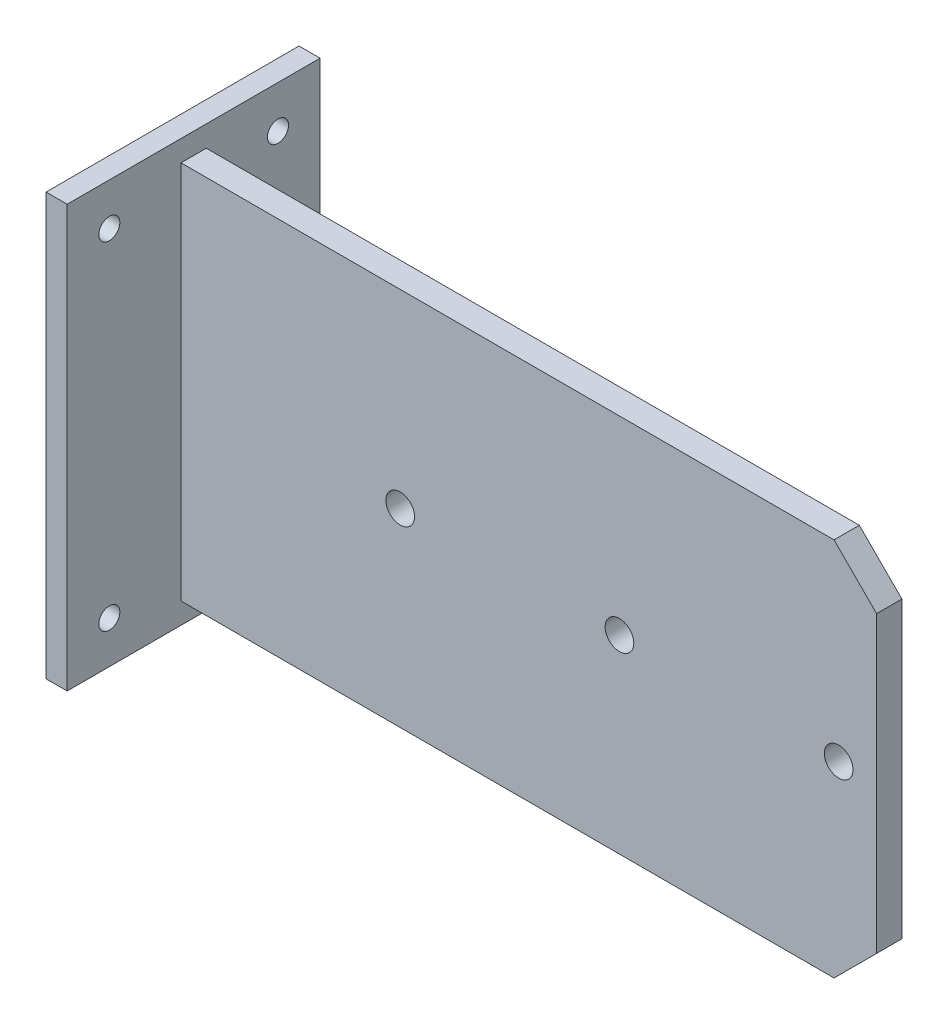
ISO-10303-21;
HEADER;
FILE_DESCRIPTION(('STEP AP214'),'2;1');
FILE_NAME('part.step','',(''),(''),'','','');
FILE_SCHEMA(('AUTOMOTIVE_DESIGN { 1 0 10303 214 1 1 1 1 }'));
ENDSEC;
DATA;
#1=APPLICATION_CONTEXT('core data for automotive mechanical design processes');
#2=APPLICATION_PROTOCOL_DEFINITION('international standard','automotive_design',2000,#1);
#3=PRODUCT_CONTEXT('',#1,'mechanical');
#4=PRODUCT('Part','Part','',(#3));
#5=PRODUCT_RELATED_PRODUCT_CATEGORY('part','',(#4));
#6=PRODUCT_DEFINITION_FORMATION('','',#4);
#7=PRODUCT_DEFINITION_CONTEXT('part definition',#1,'design');
#8=PRODUCT_DEFINITION('design','',#6,#7);
#9=PRODUCT_DEFINITION_SHAPE('','',#8);
#10=(LENGTH_UNIT() NAMED_UNIT(*) SI_UNIT(.MILLI.,.METRE.));
#11=(NAMED_UNIT(*) PLANE_ANGLE_UNIT() SI_UNIT($,.RADIAN.));
#12=(NAMED_UNIT(*) SI_UNIT($,.STERADIAN.) SOLID_ANGLE_UNIT());
#13=UNCERTAINTY_MEASURE_WITH_UNIT(LENGTH_MEASURE(1.E-05),#10,'distance_accuracy_value','');
#14=(GEOMETRIC_REPRESENTATION_CONTEXT(3) GLOBAL_UNCERTAINTY_ASSIGNED_CONTEXT((#13)) GLOBAL_UNIT_ASSIGNED_CONTEXT((#10,
#11,#12)) REPRESENTATION_CONTEXT('',''));
#15=CARTESIAN_POINT('',(0.,0.,0.));
#16=DIRECTION('',(0.,0.,1.));
#17=DIRECTION('',(1.,0.,0.));
#18=AXIS2_PLACEMENT_3D('',#15,#16,#17);
#19=CARTESIAN_POINT('',(63.4999999999999,-1270.,762.));
#20=DIRECTION('',(-1.,0.,0.));
#21=DIRECTION('',(0.,0.,1.));
#22=AXIS2_PLACEMENT_3D('',#19,#20,#21);
#23=PLANE('',#22);
#24=CARTESIAN_POINT('',(63.4999999999999,1016.,508.));
#25=DIRECTION('',(-1.,0.,0.));
#26=DIRECTION('',(0.,0.,1.));
#27=AXIS2_PLACEMENT_3D('',#24,#25,#26);
#28=CIRCLE('',#27,63.4999999999999);
#29=CARTESIAN_POINT('',(63.4999999999999,1016.,571.5));
#30=VERTEX_POINT('',#29);
#31=EDGE_CURVE('E158',#30,#30,#28,.T.);
#32=ORIENTED_EDGE('',*,*,#31,.T.);
#33=EDGE_LOOP('',(#32));
#34=FACE_BOUND('',#33,.T.);
#35=CARTESIAN_POINT('',(63.4999999999999,-1016.,508.));
#36=DIRECTION('',(-1.,0.,0.));
#37=DIRECTION('',(0.,0.,1.));
#38=AXIS2_PLACEMENT_3D('',#35,#36,#37);
#39=CIRCLE('',#38,63.5);
#40=CARTESIAN_POINT('',(63.4999999999999,-1016.,571.5));
#41=VERTEX_POINT('',#40);
#42=EDGE_CURVE('E391',#41,#41,#39,.T.);
#43=ORIENTED_EDGE('',*,*,#42,.T.);
#44=EDGE_LOOP('',(#43));
#45=FACE_BOUND('',#44,.T.);
#46=CARTESIAN_POINT('',(63.4999999999999,-1016.,-508.));
#47=DIRECTION('',(-1.,0.,0.));
#48=DIRECTION('',(0.,0.,1.));
#49=AXIS2_PLACEMENT_3D('',#46,#47,#48);
#50=CIRCLE('',#49,63.5);
#51=CARTESIAN_POINT('',(63.4999999999999,-1016.,-444.5));
#52=VERTEX_POINT('',#51);
#53=EDGE_CURVE('E388',#52,#52,#50,.T.);
#54=ORIENTED_EDGE('',*,*,#53,.T.);
#55=EDGE_LOOP('',(#54));
#56=FACE_BOUND('',#55,.T.);
#57=CARTESIAN_POINT('',(63.4999999999999,1016.,-508.));
#58=DIRECTION('',(-1.,0.,0.));
#59=DIRECTION('',(0.,0.,1.));
#60=AXIS2_PLACEMENT_3D('',#57,#58,#59);
#61=CIRCLE('',#60,63.5);
#62=CARTESIAN_POINT('',(63.4999999999999,1016.,-444.5));
#63=VERTEX_POINT('',#62);
#64=EDGE_CURVE('E384',#63,#63,#61,.T.);
#65=ORIENTED_EDGE('',*,*,#64,.T.);
#66=EDGE_LOOP('',(#65));
#67=FACE_BOUND('',#66,.T.);
#68=DIRECTION('',(0.,1.,0.));
#69=VECTOR('',#68,1.);
#70=CARTESIAN_POINT('',(63.4999999999999,-1270.,-762.));
#71=LINE('',#70,#69);
#72=CARTESIAN_POINT('',(63.4999999999999,-1270.,-762.));
#73=VERTEX_POINT('',#72);
#74=CARTESIAN_POINT('',(63.4999999999999,1270.,-762.));
#75=VERTEX_POINT('',#74);
#76=EDGE_CURVE('E197',#73,#75,#71,.T.);
#77=ORIENTED_EDGE('',*,*,#76,.T.);
#78=DIRECTION('',(0.,0.,-1.));
#79=VECTOR('',#78,1.);
#80=CARTESIAN_POINT('',(63.4999999999999,1270.,762.));
#81=LINE('',#80,#79);
#82=CARTESIAN_POINT('',(63.4999999999999,1270.,762.));
#83=VERTEX_POINT('',#82);
#84=EDGE_CURVE('E205',#83,#75,#81,.T.);
#85=ORIENTED_EDGE('',*,*,#84,.F.);
#86=DIRECTION('',(0.,1.,0.));
#87=VECTOR('',#86,1.);
#88=CARTESIAN_POINT('',(63.4999999999999,-1270.,762.));
#89=LINE('',#88,#87);
#90=CARTESIAN_POINT('',(63.4999999999999,-1270.,762.));
#91=VERTEX_POINT('',#90);
#92=EDGE_CURVE('E184',#91,#83,#89,.T.);
#93=ORIENTED_EDGE('',*,*,#92,.F.);
#94=DIRECTION('',(0.,0.,-1.));
#95=VECTOR('',#94,1.);
#96=CARTESIAN_POINT('',(63.4999999999999,-1270.,762.));
#97=LINE('',#96,#95);
#98=EDGE_CURVE('E209',#91,#73,#97,.T.);
#99=ORIENTED_EDGE('',*,*,#98,.T.);
#100=EDGE_LOOP('',(#77,#85,#93,#99));
#101=FACE_BOUND('',#100,.T.);
#102=DIRECTION('',(0.,1.,0.));
#103=VECTOR('',#102,1.);
#104=CARTESIAN_POINT('',(63.5000000000002,-1143.,76.2));
#105=LINE('',#104,#103);
#106=CARTESIAN_POINT('',(63.5000000000002,-1143.,76.2));
#107=VERTEX_POINT('',#106);
#108=CARTESIAN_POINT('',(63.4999999999999,1143.,76.2));
#109=VERTEX_POINT('',#108);
#110=EDGE_CURVE('E144',#107,#109,#105,.T.);
#111=ORIENTED_EDGE('',*,*,#110,.T.);
#112=DIRECTION('',(0.,0.,-1.));
#113=VECTOR('',#112,1.);
#114=CARTESIAN_POINT('',(63.4999999999999,1143.,76.2));
#115=LINE('',#114,#113);
#116=CARTESIAN_POINT('',(63.4999999999999,1143.,-76.2));
#117=VERTEX_POINT('',#116);
#118=EDGE_CURVE('E126',#109,#117,#115,.T.);
#119=ORIENTED_EDGE('',*,*,#118,.T.);
#120=DIRECTION('',(0.,1.,0.));
#121=VECTOR('',#120,1.);
#122=CARTESIAN_POINT('',(63.5000000000002,-1143.,-76.2));
#123=LINE('',#122,#121);
#124=CARTESIAN_POINT('',(63.4999999999999,-1143.,-76.2));
#125=VERTEX_POINT('',#124);
#126=EDGE_CURVE('E165',#125,#117,#123,.T.);
#127=ORIENTED_EDGE('',*,*,#126,.F.);
#128=DIRECTION('',(0.,0.,-1.));
#129=VECTOR('',#128,1.);
#130=CARTESIAN_POINT('',(63.5000000000002,-1143.,76.2));
#131=LINE('',#130,#129);
#132=EDGE_CURVE('E139',#107,#125,#131,.T.);
#133=ORIENTED_EDGE('',*,*,#132,.F.);
#134=EDGE_LOOP('',(#111,#119,#127,#133));
#135=FACE_BOUND('',#134,.T.);
#136=ADVANCED_FACE('F47',(#34,#45,#56,#67,#101,#135),#23,.F.);
#137=CARTESIAN_POINT('',(-63.5000000000001,-1270.,762.));
#138=DIRECTION('',(1.,0.,0.));
#139=DIRECTION('',(0.,0.,-1.));
#140=AXIS2_PLACEMENT_3D('',#137,#138,#139);
#141=PLANE('',#140);
#142=CARTESIAN_POINT('',(-63.5000000000001,1016.,508.));
#143=DIRECTION('',(-1.,0.,0.));
#144=DIRECTION('',(0.,0.,-1.));
#145=AXIS2_PLACEMENT_3D('',#142,#143,#144);
#146=CIRCLE('',#145,63.4999999999999);
#147=CARTESIAN_POINT('',(-63.5000000000001,1016.,444.5));
#148=VERTEX_POINT('',#147);
#149=EDGE_CURVE('E231',#148,#148,#146,.T.);
#150=ORIENTED_EDGE('',*,*,#149,.F.);
#151=EDGE_LOOP('',(#150));
#152=FACE_BOUND('',#151,.T.);
#153=CARTESIAN_POINT('',(-63.5000000000001,-1016.,508.));
#154=DIRECTION('',(-1.,0.,0.));
#155=DIRECTION('',(0.,0.,-1.));
#156=AXIS2_PLACEMENT_3D('',#153,#154,#155);
#157=CIRCLE('',#156,63.5);
#158=CARTESIAN_POINT('',(-63.5000000000001,-1016.,444.5));
#159=VERTEX_POINT('',#158);
#160=EDGE_CURVE('E374',#159,#159,#157,.T.);
#161=ORIENTED_EDGE('',*,*,#160,.F.);
#162=EDGE_LOOP('',(#161));
#163=FACE_BOUND('',#162,.T.);
#164=CARTESIAN_POINT('',(-63.5000000000001,-1016.,-508.));
#165=DIRECTION('',(-1.,0.,0.));
#166=DIRECTION('',(0.,0.,1.));
#167=AXIS2_PLACEMENT_3D('',#164,#165,#166);
#168=CIRCLE('',#167,63.5);
#169=CARTESIAN_POINT('',(-63.5000000000001,-1016.,-444.5));
#170=VERTEX_POINT('',#169);
#171=EDGE_CURVE('E369',#170,#170,#168,.T.);
#172=ORIENTED_EDGE('',*,*,#171,.F.);
#173=EDGE_LOOP('',(#172));
#174=FACE_BOUND('',#173,.T.);
#175=CARTESIAN_POINT('',(-63.5000000000001,1016.,-508.));
#176=DIRECTION('',(-1.,0.,0.));
#177=DIRECTION('',(0.,0.,1.));
#178=AXIS2_PLACEMENT_3D('',#175,#176,#177);
#179=CIRCLE('',#178,63.5);
#180=CARTESIAN_POINT('',(-63.5000000000001,1016.,-444.5));
#181=VERTEX_POINT('',#180);
#182=EDGE_CURVE('E373',#181,#181,#179,.T.);
#183=ORIENTED_EDGE('',*,*,#182,.F.);
#184=EDGE_LOOP('',(#183));
#185=FACE_BOUND('',#184,.T.);
#186=DIRECTION('',(0.,-1.,0.));
#187=VECTOR('',#186,1.);
#188=CARTESIAN_POINT('',(-63.5000000000001,-1270.,-762.));
#189=LINE('',#188,#187);
#190=CARTESIAN_POINT('',(-63.5000000000001,1270.,-762.));
#191=VERTEX_POINT('',#190);
#192=CARTESIAN_POINT('',(-63.5000000000001,-1270.,-762.));
#193=VERTEX_POINT('',#192);
#194=EDGE_CURVE('E174',#191,#193,#189,.T.);
#195=ORIENTED_EDGE('',*,*,#194,.T.);
#196=DIRECTION('',(0.,0.,-1.));
#197=VECTOR('',#196,1.);
#198=CARTESIAN_POINT('',(-63.5000000000001,-1270.,762.));
#199=LINE('',#198,#197);
#200=CARTESIAN_POINT('',(-63.5000000000001,-1270.,762.));
#201=VERTEX_POINT('',#200);
#202=EDGE_CURVE('E213',#201,#193,#199,.T.);
#203=ORIENTED_EDGE('',*,*,#202,.F.);
#204=DIRECTION('',(0.,-1.,0.));
#205=VECTOR('',#204,1.);
#206=CARTESIAN_POINT('',(-63.5000000000001,-1270.,762.));
#207=LINE('',#206,#205);
#208=CARTESIAN_POINT('',(-63.5000000000001,1270.,762.));
#209=VERTEX_POINT('',#208);
#210=EDGE_CURVE('E176',#209,#201,#207,.T.);
#211=ORIENTED_EDGE('',*,*,#210,.F.);
#212=DIRECTION('',(0.,0.,-1.));
#213=VECTOR('',#212,1.);
#214=CARTESIAN_POINT('',(-63.5000000000001,1270.,762.));
#215=LINE('',#214,#213);
#216=EDGE_CURVE('E190',#209,#191,#215,.T.);
#217=ORIENTED_EDGE('',*,*,#216,.T.);
#218=EDGE_LOOP('',(#195,#203,#211,#217));
#219=FACE_BOUND('',#218,.T.);
#220=ADVANCED_FACE('F266',(#152,#163,#174,#185,#219),#141,.F.);
#221=CARTESIAN_POINT('',(63.4999999999999,-1270.,762.));
#222=DIRECTION('',(0.,1.,0.));
#223=DIRECTION('',(0.,0.,1.));
#224=AXIS2_PLACEMENT_3D('',#221,#222,#223);
#225=PLANE('',#224);
#226=DIRECTION('',(1.,0.,0.));
#227=VECTOR('',#226,1.);
#228=CARTESIAN_POINT('',(63.4999999999999,-1270.,-762.));
#229=LINE('',#228,#227);
#230=EDGE_CURVE('E194',#193,#73,#229,.T.);
#231=ORIENTED_EDGE('',*,*,#230,.T.);
#232=ORIENTED_EDGE('',*,*,#98,.F.);
#233=DIRECTION('',(1.,0.,0.));
#234=VECTOR('',#233,1.);
#235=CARTESIAN_POINT('',(63.4999999999999,-1270.,762.));
#236=LINE('',#235,#234);
#237=EDGE_CURVE('E180',#201,#91,#236,.T.);
#238=ORIENTED_EDGE('',*,*,#237,.F.);
#239=ORIENTED_EDGE('',*,*,#202,.T.);
#240=EDGE_LOOP('',(#231,#232,#238,#239));
#241=FACE_BOUND('',#240,.T.);
#242=ADVANCED_FACE('F272',(#241),#225,.F.);
#243=CARTESIAN_POINT('',(63.4999999999999,1270.,762.));
#244=DIRECTION('',(0.,-1.,0.));
#245=DIRECTION('',(0.,0.,-1.));
#246=AXIS2_PLACEMENT_3D('',#243,#244,#245);
#247=PLANE('',#246);
#248=DIRECTION('',(-1.,0.,0.));
#249=VECTOR('',#248,1.);
#250=CARTESIAN_POINT('',(63.4999999999999,1270.,-762.));
#251=LINE('',#250,#249);
#252=EDGE_CURVE('E181',#75,#191,#251,.T.);
#253=ORIENTED_EDGE('',*,*,#252,.T.);
#254=ORIENTED_EDGE('',*,*,#216,.F.);
#255=DIRECTION('',(-1.,0.,0.));
#256=VECTOR('',#255,1.);
#257=CARTESIAN_POINT('',(63.4999999999999,1270.,762.));
#258=LINE('',#257,#256);
#259=EDGE_CURVE('E187',#83,#209,#258,.T.);
#260=ORIENTED_EDGE('',*,*,#259,.F.);
#261=ORIENTED_EDGE('',*,*,#84,.T.);
#262=EDGE_LOOP('',(#253,#254,#260,#261));
#263=FACE_BOUND('',#262,.T.);
#264=ADVANCED_FACE('F279',(#263),#247,.F.);
#265=CARTESIAN_POINT('',(0.,0.,762.));
#266=DIRECTION('',(0.,0.,1.));
#267=DIRECTION('',(1.,0.,0.));
#268=AXIS2_PLACEMENT_3D('',#265,#266,#267);
#269=PLANE('',#268);
#270=ORIENTED_EDGE('',*,*,#210,.T.);
#271=ORIENTED_EDGE('',*,*,#237,.T.);
#272=ORIENTED_EDGE('',*,*,#92,.T.);
#273=ORIENTED_EDGE('',*,*,#259,.T.);
#274=EDGE_LOOP('',(#270,#271,#272,#273));
#275=FACE_BOUND('',#274,.T.);
#276=ADVANCED_FACE('F291',(#275),#269,.T.);
#277=CARTESIAN_POINT('',(0.,0.,-762.));
#278=DIRECTION('',(0.,0.,1.));
#279=DIRECTION('',(1.,0.,0.));
#280=AXIS2_PLACEMENT_3D('',#277,#278,#279);
#281=PLANE('',#280);
#282=ORIENTED_EDGE('',*,*,#194,.F.);
#283=ORIENTED_EDGE('',*,*,#252,.F.);
#284=ORIENTED_EDGE('',*,*,#76,.F.);
#285=ORIENTED_EDGE('',*,*,#230,.F.);
#286=EDGE_LOOP('',(#282,#283,#284,#285));
#287=FACE_BOUND('',#286,.T.);
#288=ADVANCED_FACE('F302',(#287),#281,.F.);
#289=CARTESIAN_POINT('',(63.5000000000002,-1143.,76.2));
#290=DIRECTION('',(0.,1.,0.));
#291=DIRECTION('',(-1.,0.,0.));
#292=AXIS2_PLACEMENT_3D('',#289,#290,#291);
#293=PLANE('',#292);
#294=DIRECTION('',(1.,0.,0.));
#295=VECTOR('',#294,1.);
#296=CARTESIAN_POINT('',(63.5000000000002,-1143.,-76.2));
#297=LINE('',#296,#295);
#298=CARTESIAN_POINT('',(3997.96,-1143.,-76.2));
#299=VERTEX_POINT('',#298);
#300=EDGE_CURVE('E152',#125,#299,#297,.T.);
#301=ORIENTED_EDGE('',*,*,#300,.T.);
#302=DIRECTION('',(0.,0.,1.));
#303=VECTOR('',#302,1.);
#304=CARTESIAN_POINT('',(3997.96,-1143.,76.2));
#305=LINE('',#304,#303);
#306=CARTESIAN_POINT('',(3997.96,-1143.,76.2));
#307=VERTEX_POINT('',#306);
#308=EDGE_CURVE('E11',#299,#307,#305,.T.);
#309=ORIENTED_EDGE('',*,*,#308,.T.);
#310=DIRECTION('',(1.,0.,0.));
#311=VECTOR('',#310,1.);
#312=CARTESIAN_POINT('',(63.5000000000002,-1143.,76.2));
#313=LINE('',#312,#311);
#314=EDGE_CURVE('E140',#107,#307,#313,.T.);
#315=ORIENTED_EDGE('',*,*,#314,.F.);
#316=ORIENTED_EDGE('',*,*,#132,.T.);
#317=EDGE_LOOP('',(#301,#309,#315,#316));
#318=FACE_BOUND('',#317,.T.);
#319=ADVANCED_FACE('F258',(#318),#293,.F.);
#320=CARTESIAN_POINT('',(4254.5,1143.,76.2));
#321=DIRECTION('',(1.,0.,0.));
#322=DIRECTION('',(0.,0.,-1.));
#323=AXIS2_PLACEMENT_3D('',#320,#321,#322);
#324=PLANE('',#323);
#325=DIRECTION('',(0.,-1.,0.));
#326=VECTOR('',#325,1.);
#327=CARTESIAN_POINT('',(4254.5,1143.,-76.2));
#328=LINE('',#327,#326);
#329=CARTESIAN_POINT('',(4254.5,886.459999999999,-76.2));
#330=VERTEX_POINT('',#329);
#331=CARTESIAN_POINT('',(4254.5,-886.459999999998,-76.2));
#332=VERTEX_POINT('',#331);
#333=EDGE_CURVE('E155',#330,#332,#328,.T.);
#334=ORIENTED_EDGE('',*,*,#333,.F.);
#335=DIRECTION('',(0.,0.,1.));
#336=VECTOR('',#335,1.);
#337=CARTESIAN_POINT('',(4254.5,886.459999999999,76.2));
#338=LINE('',#337,#336);
#339=CARTESIAN_POINT('',(4254.5,886.459999999999,76.2));
#340=VERTEX_POINT('',#339);
#341=EDGE_CURVE('E244',#330,#340,#338,.T.);
#342=ORIENTED_EDGE('',*,*,#341,.T.);
#343=DIRECTION('',(0.,-1.,0.));
#344=VECTOR('',#343,1.);
#345=CARTESIAN_POINT('',(4254.5,1143.,76.2));
#346=LINE('',#345,#344);
#347=CARTESIAN_POINT('',(4254.5,-886.459999999998,76.2));
#348=VERTEX_POINT('',#347);
#349=EDGE_CURVE('E148',#340,#348,#346,.T.);
#350=ORIENTED_EDGE('',*,*,#349,.T.);
#351=DIRECTION('',(0.,0.,-1.));
#352=VECTOR('',#351,1.);
#353=CARTESIAN_POINT('',(4254.5,-886.459999999998,-76.2));
#354=LINE('',#353,#352);
#355=EDGE_CURVE('E240',#348,#332,#354,.T.);
#356=ORIENTED_EDGE('',*,*,#355,.T.);
#357=EDGE_LOOP('',(#334,#342,#350,#356));
#358=FACE_BOUND('',#357,.T.);
#359=ADVANCED_FACE('F252',(#358),#324,.T.);
#360=CARTESIAN_POINT('',(63.4999999999999,1143.,76.2));
#361=DIRECTION('',(0.,1.,0.));
#362=DIRECTION('',(0.,0.,1.));
#363=AXIS2_PLACEMENT_3D('',#360,#361,#362);
#364=PLANE('',#363);
#365=DIRECTION('',(1.,0.,0.));
#366=VECTOR('',#365,1.);
#367=CARTESIAN_POINT('',(63.4999999999999,1143.,76.2));
#368=LINE('',#367,#366);
#369=CARTESIAN_POINT('',(3997.96,1143.,76.2));
#370=VERTEX_POINT('',#369);
#371=EDGE_CURVE('E130',#109,#370,#368,.T.);
#372=ORIENTED_EDGE('',*,*,#371,.T.);
#373=DIRECTION('',(0.,0.,-1.));
#374=VECTOR('',#373,1.);
#375=CARTESIAN_POINT('',(3997.96,1143.,76.2));
#376=LINE('',#375,#374);
#377=CARTESIAN_POINT('',(3997.96,1143.,-76.2));
#378=VERTEX_POINT('',#377);
#379=EDGE_CURVE('E217',#370,#378,#376,.T.);
#380=ORIENTED_EDGE('',*,*,#379,.T.);
#381=DIRECTION('',(1.,0.,0.));
#382=VECTOR('',#381,1.);
#383=CARTESIAN_POINT('',(63.4999999999999,1143.,-76.2));
#384=LINE('',#383,#382);
#385=EDGE_CURVE('E133',#117,#378,#384,.T.);
#386=ORIENTED_EDGE('',*,*,#385,.F.);
#387=ORIENTED_EDGE('',*,*,#118,.F.);
#388=EDGE_LOOP('',(#372,#380,#386,#387));
#389=FACE_BOUND('',#388,.T.);
#390=ADVANCED_FACE('F128',(#389),#364,.T.);
#391=CARTESIAN_POINT('',(0.,0.,76.2));
#392=DIRECTION('',(0.,0.,-1.));
#393=DIRECTION('',(-1.,0.,0.));
#394=AXIS2_PLACEMENT_3D('',#391,#392,#393);
#395=PLANE('',#394);
#396=CARTESIAN_POINT('',(4025.9,-1.33226762955019E-12,76.2));
#397=DIRECTION('',(0.,0.,1.));
#398=DIRECTION('',(1.,0.,0.));
#399=AXIS2_PLACEMENT_3D('',#396,#397,#398);
#400=CIRCLE('',#399,86.3600000000004);
#401=CARTESIAN_POINT('',(4112.26,-1.33226762955019E-12,76.2));
#402=VERTEX_POINT('',#401);
#403=EDGE_CURVE('E223',#402,#402,#400,.T.);
#404=ORIENTED_EDGE('',*,*,#403,.F.);
#405=EDGE_LOOP('',(#404));
#406=FACE_BOUND('',#405,.T.);
#407=CARTESIAN_POINT('',(2705.1,-1.33226762955019E-12,76.2));
#408=DIRECTION('',(0.,0.,1.));
#409=DIRECTION('',(1.,0.,0.));
#410=AXIS2_PLACEMENT_3D('',#407,#408,#409);
#411=CIRCLE('',#410,86.36);
#412=CARTESIAN_POINT('',(2791.46,-1.33226762955019E-12,76.2));
#413=VERTEX_POINT('',#412);
#414=EDGE_CURVE('E359',#413,#413,#411,.T.);
#415=ORIENTED_EDGE('',*,*,#414,.F.);
#416=EDGE_LOOP('',(#415));
#417=FACE_BOUND('',#416,.T.);
#418=CARTESIAN_POINT('',(1384.3,-1.33226762955019E-12,76.2));
#419=DIRECTION('',(0.,0.,1.));
#420=DIRECTION('',(1.,0.,0.));
#421=AXIS2_PLACEMENT_3D('',#418,#419,#420);
#422=CIRCLE('',#421,86.36);
#423=CARTESIAN_POINT('',(1470.66,-1.33226762955019E-12,76.2));
#424=VERTEX_POINT('',#423);
#425=EDGE_CURVE('E363',#424,#424,#422,.T.);
#426=ORIENTED_EDGE('',*,*,#425,.F.);
#427=EDGE_LOOP('',(#426));
#428=FACE_BOUND('',#427,.T.);
#429=ORIENTED_EDGE('',*,*,#349,.F.);
#430=DIRECTION('',(0.707106781186548,-0.707106781186547,0.));
#431=VECTOR('',#430,1.);
#432=CARTESIAN_POINT('',(3997.96,1143.,76.2));
#433=LINE('',#432,#431);
#434=EDGE_CURVE('E57',#340,#370,#433,.F.);
#435=ORIENTED_EDGE('',*,*,#434,.T.);
#436=ORIENTED_EDGE('',*,*,#371,.F.);
#437=ORIENTED_EDGE('',*,*,#110,.F.);
#438=ORIENTED_EDGE('',*,*,#314,.T.);
#439=DIRECTION('',(0.707106781186547,0.707106781186548,0.));
#440=VECTOR('',#439,1.);
#441=CARTESIAN_POINT('',(4254.5,-886.459999999998,76.2));
#442=LINE('',#441,#440);
#443=EDGE_CURVE('E69',#307,#348,#442,.T.);
#444=ORIENTED_EDGE('',*,*,#443,.T.);
#445=EDGE_LOOP('',(#429,#435,#436,#437,#438,#444));
#446=FACE_BOUND('',#445,.T.);
#447=ADVANCED_FACE('F143',(#406,#417,#428,#446),#395,.F.);
#448=CARTESIAN_POINT('',(0.,0.,-76.2));
#449=DIRECTION('',(0.,0.,-1.));
#450=DIRECTION('',(-1.,0.,0.));
#451=AXIS2_PLACEMENT_3D('',#448,#449,#450);
#452=PLANE('',#451);
#453=CARTESIAN_POINT('',(4025.9,-1.33226762955019E-12,-76.2));
#454=DIRECTION('',(0.,0.,-1.));
#455=DIRECTION('',(-1.,0.,0.));
#456=AXIS2_PLACEMENT_3D('',#453,#454,#455);
#457=CIRCLE('',#456,86.3600000000004);
#458=CARTESIAN_POINT('',(3939.54,-1.33226762955019E-12,-76.2));
#459=VERTEX_POINT('',#458);
#460=EDGE_CURVE('E227',#459,#459,#457,.T.);
#461=ORIENTED_EDGE('',*,*,#460,.F.);
#462=EDGE_LOOP('',(#461));
#463=FACE_BOUND('',#462,.T.);
#464=CARTESIAN_POINT('',(2705.1,-1.33226762955019E-12,-76.2));
#465=DIRECTION('',(0.,0.,-1.));
#466=DIRECTION('',(-1.,0.,0.));
#467=AXIS2_PLACEMENT_3D('',#464,#465,#466);
#468=CIRCLE('',#467,86.36);
#469=CARTESIAN_POINT('',(2618.74,-1.33226762955019E-12,-76.2));
#470=VERTEX_POINT('',#469);
#471=EDGE_CURVE('E222',#470,#470,#468,.T.);
#472=ORIENTED_EDGE('',*,*,#471,.F.);
#473=EDGE_LOOP('',(#472));
#474=FACE_BOUND('',#473,.T.);
#475=CARTESIAN_POINT('',(1384.3,-1.33226762955019E-12,-76.2));
#476=DIRECTION('',(0.,0.,-1.));
#477=DIRECTION('',(-1.,0.,0.));
#478=AXIS2_PLACEMENT_3D('',#475,#476,#477);
#479=CIRCLE('',#478,86.36);
#480=CARTESIAN_POINT('',(1297.94,-1.33226762955019E-12,-76.2));
#481=VERTEX_POINT('',#480);
#482=EDGE_CURVE('E218',#481,#481,#479,.T.);
#483=ORIENTED_EDGE('',*,*,#482,.F.);
#484=EDGE_LOOP('',(#483));
#485=FACE_BOUND('',#484,.T.);
#486=ORIENTED_EDGE('',*,*,#385,.T.);
#487=DIRECTION('',(-0.707106781186548,0.707106781186547,0.));
#488=VECTOR('',#487,1.);
#489=CARTESIAN_POINT('',(2570.48,2570.48,-76.2));
#490=LINE('',#489,#488);
#491=EDGE_CURVE('E237',#378,#330,#490,.F.);
#492=ORIENTED_EDGE('',*,*,#491,.T.);
#493=ORIENTED_EDGE('',*,*,#333,.T.);
#494=DIRECTION('',(-0.707106781186547,-0.707106781186548,0.));
#495=VECTOR('',#494,1.);
#496=CARTESIAN_POINT('',(2570.48,-2570.48,-76.2));
#497=LINE('',#496,#495);
#498=EDGE_CURVE('E234',#332,#299,#497,.T.);
#499=ORIENTED_EDGE('',*,*,#498,.T.);
#500=ORIENTED_EDGE('',*,*,#300,.F.);
#501=ORIENTED_EDGE('',*,*,#126,.T.);
#502=EDGE_LOOP('',(#486,#492,#493,#499,#500,#501));
#503=FACE_BOUND('',#502,.T.);
#504=ADVANCED_FACE('F257',(#463,#474,#485,#503),#452,.T.);
#505=CARTESIAN_POINT('',(88.8999999999999,1016.,-508.));
#506=DIRECTION('',(-1.,0.,0.));
#507=DIRECTION('',(0.,0.,1.));
#508=AXIS2_PLACEMENT_3D('',#505,#506,#507);
#509=CYLINDRICAL_SURFACE('',#508,63.5);
#510=ORIENTED_EDGE('',*,*,#182,.T.);
#511=EDGE_LOOP('',(#510));
#512=FACE_BOUND('',#511,.T.);
#513=ORIENTED_EDGE('',*,*,#64,.F.);
#514=EDGE_LOOP('',(#513));
#515=FACE_BOUND('',#514,.T.);
#516=ADVANCED_FACE('F322',(#512,#515),#509,.F.);
#517=CARTESIAN_POINT('',(88.8999999999999,-1016.,-508.));
#518=DIRECTION('',(-1.,0.,0.));
#519=DIRECTION('',(0.,0.,1.));
#520=AXIS2_PLACEMENT_3D('',#517,#518,#519);
#521=CYLINDRICAL_SURFACE('',#520,63.5);
#522=ORIENTED_EDGE('',*,*,#171,.T.);
#523=EDGE_LOOP('',(#522));
#524=FACE_BOUND('',#523,.T.);
#525=ORIENTED_EDGE('',*,*,#53,.F.);
#526=EDGE_LOOP('',(#525));
#527=FACE_BOUND('',#526,.T.);
#528=ADVANCED_FACE('F329',(#524,#527),#521,.F.);
#529=CARTESIAN_POINT('',(88.8999999999999,-1016.,508.));
#530=DIRECTION('',(-1.,0.,0.));
#531=DIRECTION('',(0.,0.,1.));
#532=AXIS2_PLACEMENT_3D('',#529,#530,#531);
#533=CYLINDRICAL_SURFACE('',#532,63.5);
#534=ORIENTED_EDGE('',*,*,#160,.T.);
#535=EDGE_LOOP('',(#534));
#536=FACE_BOUND('',#535,.T.);
#537=ORIENTED_EDGE('',*,*,#42,.F.);
#538=EDGE_LOOP('',(#537));
#539=FACE_BOUND('',#538,.T.);
#540=ADVANCED_FACE('F335',(#536,#539),#533,.F.);
#541=CARTESIAN_POINT('',(88.8999999999999,1016.,508.));
#542=DIRECTION('',(-1.,0.,0.));
#543=DIRECTION('',(0.,0.,1.));
#544=AXIS2_PLACEMENT_3D('',#541,#542,#543);
#545=CYLINDRICAL_SURFACE('',#544,63.4999999999999);
#546=ORIENTED_EDGE('',*,*,#149,.T.);
#547=EDGE_LOOP('',(#546));
#548=FACE_BOUND('',#547,.T.);
#549=ORIENTED_EDGE('',*,*,#31,.F.);
#550=EDGE_LOOP('',(#549));
#551=FACE_BOUND('',#550,.T.);
#552=ADVANCED_FACE('F331',(#548,#551),#545,.F.);
#553=CARTESIAN_POINT('',(1384.3,-1.33226762955019E-12,-762.));
#554=DIRECTION('',(0.,0.,1.));
#555=DIRECTION('',(1.,0.,0.));
#556=AXIS2_PLACEMENT_3D('',#553,#554,#555);
#557=CYLINDRICAL_SURFACE('',#556,86.36);
#558=ORIENTED_EDGE('',*,*,#482,.T.);
#559=EDGE_LOOP('',(#558));
#560=FACE_BOUND('',#559,.T.);
#561=ORIENTED_EDGE('',*,*,#425,.T.);
#562=EDGE_LOOP('',(#561));
#563=FACE_BOUND('',#562,.T.);
#564=ADVANCED_FACE('F334',(#560,#563),#557,.F.);
#565=CARTESIAN_POINT('',(2705.1,-1.33226762955019E-12,-762.));
#566=DIRECTION('',(0.,0.,1.));
#567=DIRECTION('',(1.,0.,0.));
#568=AXIS2_PLACEMENT_3D('',#565,#566,#567);
#569=CYLINDRICAL_SURFACE('',#568,86.36);
#570=ORIENTED_EDGE('',*,*,#471,.T.);
#571=EDGE_LOOP('',(#570));
#572=FACE_BOUND('',#571,.T.);
#573=ORIENTED_EDGE('',*,*,#414,.T.);
#574=EDGE_LOOP('',(#573));
#575=FACE_BOUND('',#574,.T.);
#576=ADVANCED_FACE('F345',(#572,#575),#569,.F.);
#577=CARTESIAN_POINT('',(4025.9,-1.33226762955019E-12,-762.));
#578=DIRECTION('',(0.,0.,1.));
#579=DIRECTION('',(1.,0.,0.));
#580=AXIS2_PLACEMENT_3D('',#577,#578,#579);
#581=CYLINDRICAL_SURFACE('',#580,86.3600000000004);
#582=ORIENTED_EDGE('',*,*,#460,.T.);
#583=EDGE_LOOP('',(#582));
#584=FACE_BOUND('',#583,.T.);
#585=ORIENTED_EDGE('',*,*,#403,.T.);
#586=EDGE_LOOP('',(#585));
#587=FACE_BOUND('',#586,.T.);
#588=ADVANCED_FACE('F264',(#584,#587),#581,.F.);
#589=CARTESIAN_POINT('',(3997.96,1143.,76.2));
#590=DIRECTION('',(-0.707106781186547,-0.707106781186548,0.));
#591=DIRECTION('',(0.,0.,-1.));
#592=AXIS2_PLACEMENT_3D('',#589,#590,#591);
#593=PLANE('',#592);
#594=ORIENTED_EDGE('',*,*,#434,.F.);
#595=ORIENTED_EDGE('',*,*,#341,.F.);
#596=ORIENTED_EDGE('',*,*,#491,.F.);
#597=ORIENTED_EDGE('',*,*,#379,.F.);
#598=EDGE_LOOP('',(#594,#595,#596,#597));
#599=FACE_BOUND('',#598,.T.);
#600=ADVANCED_FACE('F255',(#599),#593,.F.);
#601=CARTESIAN_POINT('',(4254.5,-886.459999999998,76.2));
#602=DIRECTION('',(0.707106781186548,-0.707106781186547,0.));
#603=DIRECTION('',(0.,0.,1.));
#604=AXIS2_PLACEMENT_3D('',#601,#602,#603);
#605=PLANE('',#604);
#606=ORIENTED_EDGE('',*,*,#443,.F.);
#607=ORIENTED_EDGE('',*,*,#308,.F.);
#608=ORIENTED_EDGE('',*,*,#498,.F.);
#609=ORIENTED_EDGE('',*,*,#355,.F.);
#610=EDGE_LOOP('',(#606,#607,#608,#609));
#611=FACE_BOUND('',#610,.T.);
#612=ADVANCED_FACE('F50',(#611),#605,.T.);
#613=CLOSED_SHELL('',(#136,#220,#242,#264,#276,#288,#319,#359,#390,#447,#504,#516,#528,#540,
#552,#564,#576,#588,#600,#612));
#614=MANIFOLD_SOLID_BREP('B2',#613);
#615=ADVANCED_BREP_SHAPE_REPRESENTATION('',(#18,#614),#14);
#616=SHAPE_DEFINITION_REPRESENTATION(#9,#615);
ENDSEC;
END-ISO-10303-21;
